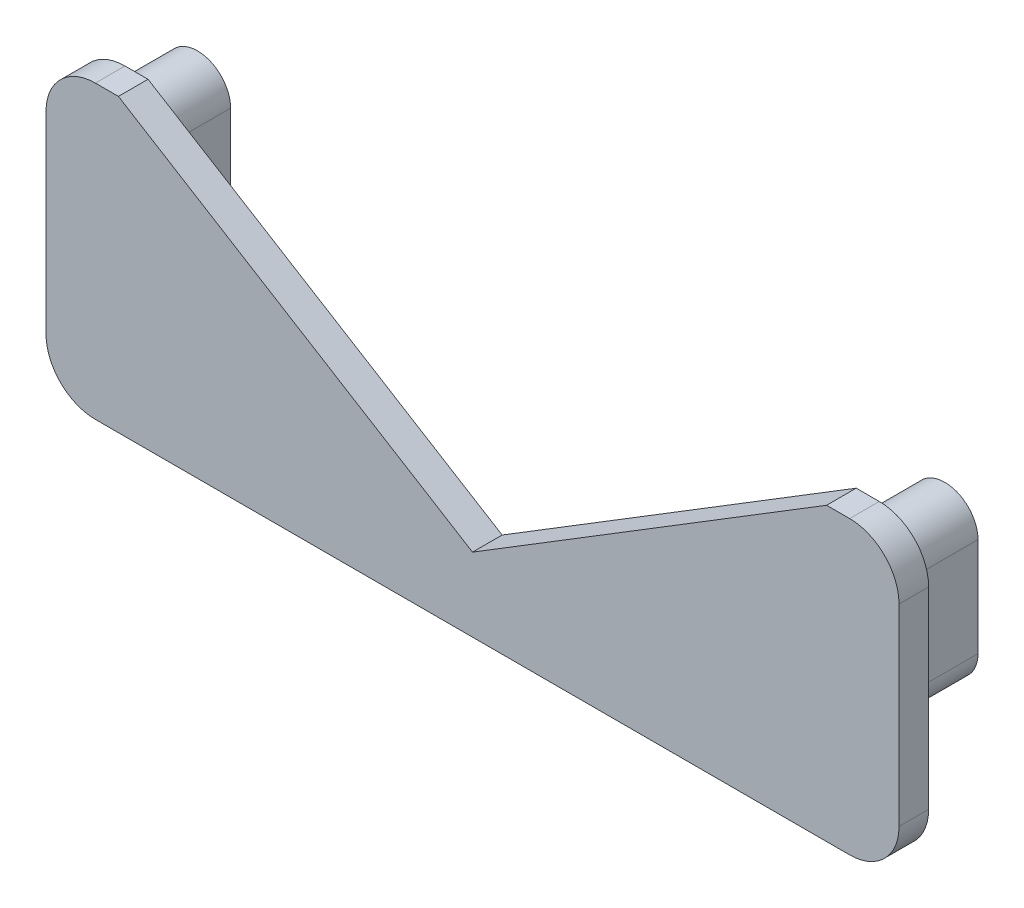
ISO-10303-21;
HEADER;
FILE_DESCRIPTION(('STEP AP214'),'2;1');
FILE_NAME('part.step','',(''),(''),'','','');
FILE_SCHEMA(('AUTOMOTIVE_DESIGN { 1 0 10303 214 1 1 1 1 }'));
ENDSEC;
DATA;
#1=APPLICATION_CONTEXT('core data for automotive mechanical design processes');
#2=APPLICATION_PROTOCOL_DEFINITION('international standard','automotive_design',2000,#1);
#3=PRODUCT_CONTEXT('',#1,'mechanical');
#4=PRODUCT('Part','Part','',(#3));
#5=PRODUCT_RELATED_PRODUCT_CATEGORY('part','',(#4));
#6=PRODUCT_DEFINITION_FORMATION('','',#4);
#7=PRODUCT_DEFINITION_CONTEXT('part definition',#1,'design');
#8=PRODUCT_DEFINITION('design','',#6,#7);
#9=PRODUCT_DEFINITION_SHAPE('','',#8);
#10=(LENGTH_UNIT() NAMED_UNIT(*) SI_UNIT(.MILLI.,.METRE.));
#11=(NAMED_UNIT(*) PLANE_ANGLE_UNIT() SI_UNIT($,.RADIAN.));
#12=(NAMED_UNIT(*) SI_UNIT($,.STERADIAN.) SOLID_ANGLE_UNIT());
#13=UNCERTAINTY_MEASURE_WITH_UNIT(LENGTH_MEASURE(1.E-05),#10,'distance_accuracy_value','');
#14=(GEOMETRIC_REPRESENTATION_CONTEXT(3) GLOBAL_UNCERTAINTY_ASSIGNED_CONTEXT((#13)) GLOBAL_UNIT_ASSIGNED_CONTEXT((#10,
#11,#12)) REPRESENTATION_CONTEXT('',''));
#15=CARTESIAN_POINT('',(0.,0.,0.));
#16=DIRECTION('',(0.,0.,1.));
#17=DIRECTION('',(1.,0.,0.));
#18=AXIS2_PLACEMENT_3D('',#15,#16,#17);
#19=CARTESIAN_POINT('',(-38.2,9.75195405052953,3.));
#20=DIRECTION('',(0.,0.,-1.));
#21=DIRECTION('',(-1.,0.,0.));
#22=AXIS2_PLACEMENT_3D('',#19,#20,#21);
#23=CYLINDRICAL_SURFACE('',#22,5.);
#24=CARTESIAN_POINT('',(-38.2,9.75195405052953,0.));
#25=DIRECTION('',(0.,0.,1.));
#26=DIRECTION('',(1.,0.,0.));
#27=AXIS2_PLACEMENT_3D('',#24,#25,#26);
#28=CIRCLE('',#27,5.);
#29=CARTESIAN_POINT('',(-43.2,9.75195405052953,0.));
#30=VERTEX_POINT('',#29);
#31=CARTESIAN_POINT('',(-38.2,14.7519540505295,0.));
#32=VERTEX_POINT('',#31);
#33=EDGE_CURVE('E227',#30,#32,#28,.F.);
#34=ORIENTED_EDGE('',*,*,#33,.F.);
#35=DIRECTION('',(0.,0.,-1.));
#36=VECTOR('',#35,1.);
#37=CARTESIAN_POINT('',(-43.2,9.75195405052953,3.));
#38=LINE('',#37,#36);
#39=CARTESIAN_POINT('',(-43.2,9.75195405052953,3.));
#40=VERTEX_POINT('',#39);
#41=EDGE_CURVE('E11',#40,#30,#38,.T.);
#42=ORIENTED_EDGE('',*,*,#41,.F.);
#43=CARTESIAN_POINT('',(-38.2,9.75195405052953,3.));
#44=DIRECTION('',(0.,0.,1.));
#45=DIRECTION('',(1.,0.,0.));
#46=AXIS2_PLACEMENT_3D('',#43,#44,#45);
#47=CIRCLE('',#46,5.);
#48=CARTESIAN_POINT('',(-38.2,14.7519540505295,3.));
#49=VERTEX_POINT('',#48);
#50=EDGE_CURVE('E233',#40,#49,#47,.F.);
#51=ORIENTED_EDGE('',*,*,#50,.T.);
#52=DIRECTION('',(0.,0.,-1.));
#53=VECTOR('',#52,1.);
#54=CARTESIAN_POINT('',(-38.2,14.7519540505295,3.));
#55=LINE('',#54,#53);
#56=EDGE_CURVE('E289',#49,#32,#55,.T.);
#57=ORIENTED_EDGE('',*,*,#56,.T.);
#58=EDGE_LOOP('',(#34,#42,#51,#57));
#59=FACE_BOUND('',#58,.T.);
#60=ADVANCED_FACE('F33',(#59),#23,.T.);
#61=CARTESIAN_POINT('',(-43.2,0.,3.));
#62=DIRECTION('',(-1.,0.,0.));
#63=DIRECTION('',(0.,0.,1.));
#64=AXIS2_PLACEMENT_3D('',#61,#62,#63);
#65=PLANE('',#64);
#66=DIRECTION('',(0.,1.,0.));
#67=VECTOR('',#66,1.);
#68=CARTESIAN_POINT('',(-43.2,0.,0.));
#69=LINE('',#68,#67);
#70=CARTESIAN_POINT('',(-43.2,-9.75195405052953,0.));
#71=VERTEX_POINT('',#70);
#72=EDGE_CURVE('E264',#71,#30,#69,.T.);
#73=ORIENTED_EDGE('',*,*,#72,.F.);
#74=DIRECTION('',(0.,0.,-1.));
#75=VECTOR('',#74,1.);
#76=CARTESIAN_POINT('',(-43.2,-9.75195405052953,3.));
#77=LINE('',#76,#75);
#78=CARTESIAN_POINT('',(-43.2,-9.75195405052953,3.));
#79=VERTEX_POINT('',#78);
#80=EDGE_CURVE('E40',#79,#71,#77,.T.);
#81=ORIENTED_EDGE('',*,*,#80,.F.);
#82=DIRECTION('',(0.,1.,0.));
#83=VECTOR('',#82,1.);
#84=CARTESIAN_POINT('',(-43.2,0.,3.));
#85=LINE('',#84,#83);
#86=EDGE_CURVE('E236',#79,#40,#85,.T.);
#87=ORIENTED_EDGE('',*,*,#86,.T.);
#88=ORIENTED_EDGE('',*,*,#41,.T.);
#89=EDGE_LOOP('',(#73,#81,#87,#88));
#90=FACE_BOUND('',#89,.T.);
#91=ADVANCED_FACE('F315',(#90),#65,.T.);
#92=CARTESIAN_POINT('',(-38.2,-9.75195405052953,3.));
#93=DIRECTION('',(0.,0.,-1.));
#94=DIRECTION('',(-1.,0.,0.));
#95=AXIS2_PLACEMENT_3D('',#92,#93,#94);
#96=CYLINDRICAL_SURFACE('',#95,5.);
#97=CARTESIAN_POINT('',(-38.2,-9.75195405052953,0.));
#98=DIRECTION('',(0.,0.,1.));
#99=DIRECTION('',(1.,0.,0.));
#100=AXIS2_PLACEMENT_3D('',#97,#98,#99);
#101=CIRCLE('',#100,5.);
#102=CARTESIAN_POINT('',(-38.2,-14.7519540505295,0.));
#103=VERTEX_POINT('',#102);
#104=EDGE_CURVE('E267',#103,#71,#101,.F.);
#105=ORIENTED_EDGE('',*,*,#104,.F.);
#106=DIRECTION('',(0.,0.,-1.));
#107=VECTOR('',#106,1.);
#108=CARTESIAN_POINT('',(-38.2,-14.7519540505295,3.));
#109=LINE('',#108,#107);
#110=CARTESIAN_POINT('',(-38.2,-14.7519540505295,3.));
#111=VERTEX_POINT('',#110);
#112=EDGE_CURVE('E307',#111,#103,#109,.T.);
#113=ORIENTED_EDGE('',*,*,#112,.F.);
#114=CARTESIAN_POINT('',(-38.2,-9.75195405052953,3.));
#115=DIRECTION('',(0.,0.,1.));
#116=DIRECTION('',(1.,0.,0.));
#117=AXIS2_PLACEMENT_3D('',#114,#115,#116);
#118=CIRCLE('',#117,5.);
#119=EDGE_CURVE('E240',#111,#79,#118,.F.);
#120=ORIENTED_EDGE('',*,*,#119,.T.);
#121=ORIENTED_EDGE('',*,*,#80,.T.);
#122=EDGE_LOOP('',(#105,#113,#120,#121));
#123=FACE_BOUND('',#122,.T.);
#124=ADVANCED_FACE('F311',(#123),#96,.T.);
#125=CARTESIAN_POINT('',(0.,-14.7519540505295,3.));
#126=DIRECTION('',(0.,1.,0.));
#127=DIRECTION('',(0.,0.,1.));
#128=AXIS2_PLACEMENT_3D('',#125,#126,#127);
#129=PLANE('',#128);
#130=DIRECTION('',(1.,0.,0.));
#131=VECTOR('',#130,1.);
#132=CARTESIAN_POINT('',(0.,-14.7519540505295,0.));
#133=LINE('',#132,#131);
#134=CARTESIAN_POINT('',(38.2,-14.7519540505295,0.));
#135=VERTEX_POINT('',#134);
#136=EDGE_CURVE('E270',#103,#135,#133,.T.);
#137=ORIENTED_EDGE('',*,*,#136,.T.);
#138=DIRECTION('',(0.,0.,-1.));
#139=VECTOR('',#138,1.);
#140=CARTESIAN_POINT('',(38.2,-14.7519540505295,3.));
#141=LINE('',#140,#139);
#142=CARTESIAN_POINT('',(38.2,-14.7519540505295,3.));
#143=VERTEX_POINT('',#142);
#144=EDGE_CURVE('E304',#143,#135,#141,.T.);
#145=ORIENTED_EDGE('',*,*,#144,.F.);
#146=DIRECTION('',(1.,0.,0.));
#147=VECTOR('',#146,1.);
#148=CARTESIAN_POINT('',(0.,-14.7519540505295,3.));
#149=LINE('',#148,#147);
#150=EDGE_CURVE('E243',#111,#143,#149,.T.);
#151=ORIENTED_EDGE('',*,*,#150,.F.);
#152=ORIENTED_EDGE('',*,*,#112,.T.);
#153=EDGE_LOOP('',(#137,#145,#151,#152));
#154=FACE_BOUND('',#153,.T.);
#155=ADVANCED_FACE('F324',(#154),#129,.F.);
#156=CARTESIAN_POINT('',(38.2,-9.75195405052953,3.));
#157=DIRECTION('',(0.,0.,-1.));
#158=DIRECTION('',(-1.,0.,0.));
#159=AXIS2_PLACEMENT_3D('',#156,#157,#158);
#160=CYLINDRICAL_SURFACE('',#159,5.);
#161=CARTESIAN_POINT('',(38.2,-9.75195405052953,0.));
#162=DIRECTION('',(0.,0.,1.));
#163=DIRECTION('',(1.,0.,0.));
#164=AXIS2_PLACEMENT_3D('',#161,#162,#163);
#165=CIRCLE('',#164,5.);
#166=CARTESIAN_POINT('',(43.2,-9.75195405052953,0.));
#167=VERTEX_POINT('',#166);
#168=EDGE_CURVE('E272',#135,#167,#165,.T.);
#169=ORIENTED_EDGE('',*,*,#168,.T.);
#170=DIRECTION('',(0.,0.,-1.));
#171=VECTOR('',#170,1.);
#172=CARTESIAN_POINT('',(43.2,-9.75195405052953,3.));
#173=LINE('',#172,#171);
#174=CARTESIAN_POINT('',(43.2,-9.75195405052953,3.));
#175=VERTEX_POINT('',#174);
#176=EDGE_CURVE('E301',#175,#167,#173,.T.);
#177=ORIENTED_EDGE('',*,*,#176,.F.);
#178=CARTESIAN_POINT('',(38.2,-9.75195405052953,3.));
#179=DIRECTION('',(0.,0.,1.));
#180=DIRECTION('',(1.,0.,0.));
#181=AXIS2_PLACEMENT_3D('',#178,#179,#180);
#182=CIRCLE('',#181,5.);
#183=EDGE_CURVE('E245',#143,#175,#182,.T.);
#184=ORIENTED_EDGE('',*,*,#183,.F.);
#185=ORIENTED_EDGE('',*,*,#144,.T.);
#186=EDGE_LOOP('',(#169,#177,#184,#185));
#187=FACE_BOUND('',#186,.T.);
#188=ADVANCED_FACE('F328',(#187),#160,.T.);
#189=CARTESIAN_POINT('',(43.2,0.,3.));
#190=DIRECTION('',(-1.,0.,0.));
#191=DIRECTION('',(0.,0.,1.));
#192=AXIS2_PLACEMENT_3D('',#189,#190,#191);
#193=PLANE('',#192);
#194=DIRECTION('',(0.,1.,0.));
#195=VECTOR('',#194,1.);
#196=CARTESIAN_POINT('',(43.2,0.,0.));
#197=LINE('',#196,#195);
#198=CARTESIAN_POINT('',(43.2,9.75195405052953,0.));
#199=VERTEX_POINT('',#198);
#200=EDGE_CURVE('E274',#167,#199,#197,.T.);
#201=ORIENTED_EDGE('',*,*,#200,.T.);
#202=DIRECTION('',(0.,0.,-1.));
#203=VECTOR('',#202,1.);
#204=CARTESIAN_POINT('',(43.2,9.75195405052953,3.));
#205=LINE('',#204,#203);
#206=CARTESIAN_POINT('',(43.2,9.75195405052953,3.));
#207=VERTEX_POINT('',#206);
#208=EDGE_CURVE('E299',#207,#199,#205,.T.);
#209=ORIENTED_EDGE('',*,*,#208,.F.);
#210=DIRECTION('',(0.,1.,0.));
#211=VECTOR('',#210,1.);
#212=CARTESIAN_POINT('',(43.2,0.,3.));
#213=LINE('',#212,#211);
#214=EDGE_CURVE('E247',#175,#207,#213,.T.);
#215=ORIENTED_EDGE('',*,*,#214,.F.);
#216=ORIENTED_EDGE('',*,*,#176,.T.);
#217=EDGE_LOOP('',(#201,#209,#215,#216));
#218=FACE_BOUND('',#217,.T.);
#219=ADVANCED_FACE('F359',(#218),#193,.F.);
#220=CARTESIAN_POINT('',(38.2,9.75195405052953,3.));
#221=DIRECTION('',(0.,0.,-1.));
#222=DIRECTION('',(-1.,0.,0.));
#223=AXIS2_PLACEMENT_3D('',#220,#221,#222);
#224=CYLINDRICAL_SURFACE('',#223,5.);
#225=CARTESIAN_POINT('',(38.2,9.75195405052953,0.));
#226=DIRECTION('',(0.,0.,1.));
#227=DIRECTION('',(1.,0.,0.));
#228=AXIS2_PLACEMENT_3D('',#225,#226,#227);
#229=CIRCLE('',#228,5.);
#230=CARTESIAN_POINT('',(38.2,14.7519540505295,0.));
#231=VERTEX_POINT('',#230);
#232=EDGE_CURVE('E277',#231,#199,#229,.F.);
#233=ORIENTED_EDGE('',*,*,#232,.F.);
#234=DIRECTION('',(0.,0.,-1.));
#235=VECTOR('',#234,1.);
#236=CARTESIAN_POINT('',(38.2,14.7519540505295,3.));
#237=LINE('',#236,#235);
#238=CARTESIAN_POINT('',(38.2,14.7519540505295,3.));
#239=VERTEX_POINT('',#238);
#240=EDGE_CURVE('E297',#239,#231,#237,.T.);
#241=ORIENTED_EDGE('',*,*,#240,.F.);
#242=CARTESIAN_POINT('',(38.2,9.75195405052953,3.));
#243=DIRECTION('',(0.,0.,1.));
#244=DIRECTION('',(1.,0.,0.));
#245=AXIS2_PLACEMENT_3D('',#242,#243,#244);
#246=CIRCLE('',#245,5.);
#247=EDGE_CURVE('E249',#239,#207,#246,.F.);
#248=ORIENTED_EDGE('',*,*,#247,.T.);
#249=ORIENTED_EDGE('',*,*,#208,.T.);
#250=EDGE_LOOP('',(#233,#241,#248,#249));
#251=FACE_BOUND('',#250,.T.);
#252=ADVANCED_FACE('F357',(#251),#224,.T.);
#253=CARTESIAN_POINT('',(0.,14.7519540505295,3.));
#254=DIRECTION('',(0.,1.,0.));
#255=DIRECTION('',(0.,0.,1.));
#256=AXIS2_PLACEMENT_3D('',#253,#254,#255);
#257=PLANE('',#256);
#258=DIRECTION('',(1.,0.,0.));
#259=VECTOR('',#258,1.);
#260=CARTESIAN_POINT('',(0.,14.7519540505295,0.));
#261=LINE('',#260,#259);
#262=CARTESIAN_POINT('',(35.8659694029692,14.7519540505295,0.));
#263=VERTEX_POINT('',#262);
#264=EDGE_CURVE('E280',#263,#231,#261,.T.);
#265=ORIENTED_EDGE('',*,*,#264,.F.);
#266=DIRECTION('',(0.,0.,-1.));
#267=VECTOR('',#266,1.);
#268=CARTESIAN_POINT('',(35.8659694029692,14.7519540505295,3.));
#269=LINE('',#268,#267);
#270=CARTESIAN_POINT('',(35.8659694029692,14.7519540505295,3.));
#271=VERTEX_POINT('',#270);
#272=EDGE_CURVE('E295',#271,#263,#269,.T.);
#273=ORIENTED_EDGE('',*,*,#272,.F.);
#274=DIRECTION('',(1.,0.,0.));
#275=VECTOR('',#274,1.);
#276=CARTESIAN_POINT('',(0.,14.7519540505295,3.));
#277=LINE('',#276,#275);
#278=EDGE_CURVE('E252',#271,#239,#277,.T.);
#279=ORIENTED_EDGE('',*,*,#278,.T.);
#280=ORIENTED_EDGE('',*,*,#240,.T.);
#281=EDGE_LOOP('',(#265,#273,#279,#280));
#282=FACE_BOUND('',#281,.T.);
#283=ADVANCED_FACE('F354',(#282),#257,.T.);
#284=CARTESIAN_POINT('',(3.25282861578107,-5.29248754943,3.));
#285=DIRECTION('',(-0.52362017763505,0.851951823504967,0.));
#286=DIRECTION('',(-0.851951823504967,-0.52362017763505,0.));
#287=AXIS2_PLACEMENT_3D('',#284,#285,#286);
#288=PLANE('',#287);
#289=DIRECTION('',(0.851951823504967,0.52362017763505,0.));
#290=VECTOR('',#289,1.);
#291=CARTESIAN_POINT('',(3.25282861578107,-5.29248754943,0.));
#292=LINE('',#291,#290);
#293=CARTESIAN_POINT('',(0.,-7.29171643845852,0.));
#294=VERTEX_POINT('',#293);
#295=EDGE_CURVE('E283',#294,#263,#292,.T.);
#296=ORIENTED_EDGE('',*,*,#295,.F.);
#297=DIRECTION('',(0.,0.,-1.));
#298=VECTOR('',#297,1.);
#299=CARTESIAN_POINT('',(0.,-7.29171643845852,3.));
#300=LINE('',#299,#298);
#301=CARTESIAN_POINT('',(0.,-7.29171643845852,3.));
#302=VERTEX_POINT('',#301);
#303=EDGE_CURVE('E293',#302,#294,#300,.T.);
#304=ORIENTED_EDGE('',*,*,#303,.F.);
#305=DIRECTION('',(0.851951823504967,0.52362017763505,0.));
#306=VECTOR('',#305,1.);
#307=CARTESIAN_POINT('',(3.25282861578107,-5.29248754943,3.));
#308=LINE('',#307,#306);
#309=EDGE_CURVE('E255',#302,#271,#308,.T.);
#310=ORIENTED_EDGE('',*,*,#309,.T.);
#311=ORIENTED_EDGE('',*,*,#272,.T.);
#312=EDGE_LOOP('',(#296,#304,#310,#311));
#313=FACE_BOUND('',#312,.T.);
#314=ADVANCED_FACE('F350',(#313),#288,.T.);
#315=CARTESIAN_POINT('',(-3.25282861578107,-5.29248754943,3.));
#316=DIRECTION('',(0.52362017763505,0.851951823504967,0.));
#317=DIRECTION('',(-0.851951823504967,0.52362017763505,0.));
#318=AXIS2_PLACEMENT_3D('',#315,#316,#317);
#319=PLANE('',#318);
#320=DIRECTION('',(0.851951823504967,-0.52362017763505,0.));
#321=VECTOR('',#320,1.);
#322=CARTESIAN_POINT('',(-3.25282861578107,-5.29248754943,0.));
#323=LINE('',#322,#321);
#324=CARTESIAN_POINT('',(-35.8659694029692,14.7519540505295,0.));
#325=VERTEX_POINT('',#324);
#326=EDGE_CURVE('E286',#325,#294,#323,.T.);
#327=ORIENTED_EDGE('',*,*,#326,.F.);
#328=DIRECTION('',(0.,0.,-1.));
#329=VECTOR('',#328,1.);
#330=CARTESIAN_POINT('',(-35.8659694029692,14.7519540505295,3.));
#331=LINE('',#330,#329);
#332=CARTESIAN_POINT('',(-35.8659694029692,14.7519540505295,3.));
#333=VERTEX_POINT('',#332);
#334=EDGE_CURVE('E291',#333,#325,#331,.T.);
#335=ORIENTED_EDGE('',*,*,#334,.F.);
#336=DIRECTION('',(0.851951823504967,-0.52362017763505,0.));
#337=VECTOR('',#336,1.);
#338=CARTESIAN_POINT('',(-3.25282861578107,-5.29248754943,3.));
#339=LINE('',#338,#337);
#340=EDGE_CURVE('E259',#333,#302,#339,.T.);
#341=ORIENTED_EDGE('',*,*,#340,.T.);
#342=ORIENTED_EDGE('',*,*,#303,.T.);
#343=EDGE_LOOP('',(#327,#335,#341,#342));
#344=FACE_BOUND('',#343,.T.);
#345=ADVANCED_FACE('F346',(#344),#319,.T.);
#346=EDGE_CURVE('E237',#32,#325,#261,.T.);
#347=ORIENTED_EDGE('',*,*,#346,.F.);
#348=ORIENTED_EDGE('',*,*,#56,.F.);
#349=EDGE_CURVE('E256',#49,#333,#277,.T.);
#350=ORIENTED_EDGE('',*,*,#349,.T.);
#351=ORIENTED_EDGE('',*,*,#334,.T.);
#352=EDGE_LOOP('',(#347,#348,#350,#351));
#353=FACE_BOUND('',#352,.T.);
#354=ADVANCED_FACE('F343',(#353),#257,.T.);
#355=CARTESIAN_POINT('',(0.,0.,3.));
#356=DIRECTION('',(0.,0.,1.));
#357=DIRECTION('',(1.,0.,0.));
#358=AXIS2_PLACEMENT_3D('',#355,#356,#357);
#359=PLANE('',#358);
#360=ORIENTED_EDGE('',*,*,#50,.F.);
#361=ORIENTED_EDGE('',*,*,#86,.F.);
#362=ORIENTED_EDGE('',*,*,#119,.F.);
#363=ORIENTED_EDGE('',*,*,#150,.T.);
#364=ORIENTED_EDGE('',*,*,#183,.T.);
#365=ORIENTED_EDGE('',*,*,#214,.T.);
#366=ORIENTED_EDGE('',*,*,#247,.F.);
#367=ORIENTED_EDGE('',*,*,#278,.F.);
#368=ORIENTED_EDGE('',*,*,#309,.F.);
#369=ORIENTED_EDGE('',*,*,#340,.F.);
#370=ORIENTED_EDGE('',*,*,#349,.F.);
#371=EDGE_LOOP('',(#360,#361,#362,#363,#364,#365,#366,#367,#368,#369,#370));
#372=FACE_BOUND('',#371,.T.);
#373=ADVANCED_FACE('F333',(#372),#359,.T.);
#374=CARTESIAN_POINT('',(0.,0.,0.));
#375=DIRECTION('',(0.,0.,1.));
#376=DIRECTION('',(1.,0.,0.));
#377=AXIS2_PLACEMENT_3D('',#374,#375,#376);
#378=PLANE('',#377);
#379=CARTESIAN_POINT('',(-37.85,9.40195405052953,0.));
#380=DIRECTION('',(0.,0.,1.));
#381=DIRECTION('',(1.,0.,0.));
#382=AXIS2_PLACEMENT_3D('',#379,#380,#381);
#383=CIRCLE('',#382,3.34999999999998);
#384=CARTESIAN_POINT('',(-34.5,9.40195405052953,0.));
#385=VERTEX_POINT('',#384);
#386=CARTESIAN_POINT('',(-41.2,9.40195405052953,0.));
#387=VERTEX_POINT('',#386);
#388=EDGE_CURVE('E188',#385,#387,#383,.T.);
#389=ORIENTED_EDGE('',*,*,#388,.T.);
#390=DIRECTION('',(0.,-1.,0.));
#391=VECTOR('',#390,1.);
#392=CARTESIAN_POINT('',(-41.2,0.,0.));
#393=LINE('',#392,#391);
#394=CARTESIAN_POINT('',(-41.2,-0.598045949470472,0.));
#395=VERTEX_POINT('',#394);
#396=EDGE_CURVE('E195',#387,#395,#393,.T.);
#397=ORIENTED_EDGE('',*,*,#396,.T.);
#398=CARTESIAN_POINT('',(-37.85,-0.598045949470472,0.));
#399=DIRECTION('',(0.,0.,1.));
#400=DIRECTION('',(1.,0.,0.));
#401=AXIS2_PLACEMENT_3D('',#398,#399,#400);
#402=CIRCLE('',#401,3.34999999999999);
#403=CARTESIAN_POINT('',(-34.5,-0.598045949470472,0.));
#404=VERTEX_POINT('',#403);
#405=EDGE_CURVE('E169',#395,#404,#402,.T.);
#406=ORIENTED_EDGE('',*,*,#405,.T.);
#407=DIRECTION('',(0.,-1.,0.));
#408=VECTOR('',#407,1.);
#409=CARTESIAN_POINT('',(-34.5,0.,0.));
#410=LINE('',#409,#408);
#411=EDGE_CURVE('E47',#385,#404,#410,.T.);
#412=ORIENTED_EDGE('',*,*,#411,.F.);
#413=EDGE_LOOP('',(#389,#397,#406,#412));
#414=FACE_BOUND('',#413,.T.);
#415=CARTESIAN_POINT('',(37.85,9.40195405052953,0.));
#416=DIRECTION('',(0.,0.,1.));
#417=DIRECTION('',(1.,0.,0.));
#418=AXIS2_PLACEMENT_3D('',#415,#416,#417);
#419=CIRCLE('',#418,3.35);
#420=CARTESIAN_POINT('',(41.2,9.40195405052953,0.));
#421=VERTEX_POINT('',#420);
#422=CARTESIAN_POINT('',(34.5,9.40195405052953,0.));
#423=VERTEX_POINT('',#422);
#424=EDGE_CURVE('E208',#421,#423,#419,.T.);
#425=ORIENTED_EDGE('',*,*,#424,.T.);
#426=DIRECTION('',(0.,-1.,0.));
#427=VECTOR('',#426,1.);
#428=CARTESIAN_POINT('',(34.5,0.,0.));
#429=LINE('',#428,#427);
#430=CARTESIAN_POINT('',(34.5,-0.598045949470472,0.));
#431=VERTEX_POINT('',#430);
#432=EDGE_CURVE('E200',#423,#431,#429,.T.);
#433=ORIENTED_EDGE('',*,*,#432,.T.);
#434=CARTESIAN_POINT('',(37.85,-0.598045949470472,0.));
#435=DIRECTION('',(0.,0.,1.));
#436=DIRECTION('',(1.,0.,0.));
#437=AXIS2_PLACEMENT_3D('',#434,#435,#436);
#438=CIRCLE('',#437,3.35);
#439=CARTESIAN_POINT('',(41.2,-0.598045949470472,0.));
#440=VERTEX_POINT('',#439);
#441=EDGE_CURVE('E219',#431,#440,#438,.T.);
#442=ORIENTED_EDGE('',*,*,#441,.T.);
#443=DIRECTION('',(0.,-1.,0.));
#444=VECTOR('',#443,1.);
#445=CARTESIAN_POINT('',(41.2,0.,0.));
#446=LINE('',#445,#444);
#447=EDGE_CURVE('E55',#421,#440,#446,.T.);
#448=ORIENTED_EDGE('',*,*,#447,.F.);
#449=EDGE_LOOP('',(#425,#433,#442,#448));
#450=FACE_BOUND('',#449,.T.);
#451=ORIENTED_EDGE('',*,*,#33,.T.);
#452=ORIENTED_EDGE('',*,*,#346,.T.);
#453=ORIENTED_EDGE('',*,*,#326,.T.);
#454=ORIENTED_EDGE('',*,*,#295,.T.);
#455=ORIENTED_EDGE('',*,*,#264,.T.);
#456=ORIENTED_EDGE('',*,*,#232,.T.);
#457=ORIENTED_EDGE('',*,*,#200,.F.);
#458=ORIENTED_EDGE('',*,*,#168,.F.);
#459=ORIENTED_EDGE('',*,*,#136,.F.);
#460=ORIENTED_EDGE('',*,*,#104,.T.);
#461=ORIENTED_EDGE('',*,*,#72,.T.);
#462=EDGE_LOOP('',(#451,#452,#453,#454,#455,#456,#457,#458,#459,#460,#461));
#463=FACE_BOUND('',#462,.T.);
#464=ADVANCED_FACE('F319',(#414,#450,#463),#378,.F.);
#465=CARTESIAN_POINT('',(34.5,0.,-7.));
#466=DIRECTION('',(-1.,0.,0.));
#467=DIRECTION('',(0.,0.,1.));
#468=AXIS2_PLACEMENT_3D('',#465,#466,#467);
#469=PLANE('',#468);
#470=ORIENTED_EDGE('',*,*,#432,.F.);
#471=DIRECTION('',(0.,0.,1.));
#472=VECTOR('',#471,1.);
#473=CARTESIAN_POINT('',(34.5,9.40195405052953,-7.));
#474=LINE('',#473,#472);
#475=CARTESIAN_POINT('',(34.5,9.40195405052953,-7.));
#476=VERTEX_POINT('',#475);
#477=EDGE_CURVE('E225',#476,#423,#474,.T.);
#478=ORIENTED_EDGE('',*,*,#477,.F.);
#479=DIRECTION('',(0.,-1.,0.));
#480=VECTOR('',#479,1.);
#481=CARTESIAN_POINT('',(34.5,0.,-7.));
#482=LINE('',#481,#480);
#483=CARTESIAN_POINT('',(34.5,-0.598045949470472,-7.));
#484=VERTEX_POINT('',#483);
#485=EDGE_CURVE('E204',#476,#484,#482,.T.);
#486=ORIENTED_EDGE('',*,*,#485,.T.);
#487=DIRECTION('',(0.,0.,1.));
#488=VECTOR('',#487,1.);
#489=CARTESIAN_POINT('',(34.5,-0.598045949470472,-7.));
#490=LINE('',#489,#488);
#491=EDGE_CURVE('E216',#484,#431,#490,.T.);
#492=ORIENTED_EDGE('',*,*,#491,.T.);
#493=EDGE_LOOP('',(#470,#478,#486,#492));
#494=FACE_BOUND('',#493,.T.);
#495=ADVANCED_FACE('F444',(#494),#469,.T.);
#496=CARTESIAN_POINT('',(37.85,9.40195405052953,-7.));
#497=DIRECTION('',(0.,0.,1.));
#498=DIRECTION('',(1.,0.,0.));
#499=AXIS2_PLACEMENT_3D('',#496,#497,#498);
#500=CYLINDRICAL_SURFACE('',#499,3.35);
#501=ORIENTED_EDGE('',*,*,#424,.F.);
#502=DIRECTION('',(0.,0.,1.));
#503=VECTOR('',#502,1.);
#504=CARTESIAN_POINT('',(41.2,9.40195405052953,-7.));
#505=LINE('',#504,#503);
#506=CARTESIAN_POINT('',(41.2,9.40195405052953,-7.));
#507=VERTEX_POINT('',#506);
#508=EDGE_CURVE('E228',#507,#421,#505,.T.);
#509=ORIENTED_EDGE('',*,*,#508,.F.);
#510=CARTESIAN_POINT('',(37.85,9.40195405052953,-7.));
#511=DIRECTION('',(0.,0.,1.));
#512=DIRECTION('',(1.,0.,0.));
#513=AXIS2_PLACEMENT_3D('',#510,#511,#512);
#514=CIRCLE('',#513,3.35);
#515=EDGE_CURVE('E213',#507,#476,#514,.T.);
#516=ORIENTED_EDGE('',*,*,#515,.T.);
#517=ORIENTED_EDGE('',*,*,#477,.T.);
#518=EDGE_LOOP('',(#501,#509,#516,#517));
#519=FACE_BOUND('',#518,.T.);
#520=ADVANCED_FACE('F454',(#519),#500,.T.);
#521=CARTESIAN_POINT('',(41.2,0.,-7.));
#522=DIRECTION('',(-1.,0.,0.));
#523=DIRECTION('',(0.,0.,1.));
#524=AXIS2_PLACEMENT_3D('',#521,#522,#523);
#525=PLANE('',#524);
#526=ORIENTED_EDGE('',*,*,#447,.T.);
#527=DIRECTION('',(0.,0.,1.));
#528=VECTOR('',#527,1.);
#529=CARTESIAN_POINT('',(41.2,-0.598045949470472,-7.));
#530=LINE('',#529,#528);
#531=CARTESIAN_POINT('',(41.2,-0.598045949470472,-7.));
#532=VERTEX_POINT('',#531);
#533=EDGE_CURVE('E230',#532,#440,#530,.T.);
#534=ORIENTED_EDGE('',*,*,#533,.F.);
#535=DIRECTION('',(0.,-1.,0.));
#536=VECTOR('',#535,1.);
#537=CARTESIAN_POINT('',(41.2,0.,-7.));
#538=LINE('',#537,#536);
#539=EDGE_CURVE('E211',#507,#532,#538,.T.);
#540=ORIENTED_EDGE('',*,*,#539,.F.);
#541=ORIENTED_EDGE('',*,*,#508,.T.);
#542=EDGE_LOOP('',(#526,#534,#540,#541));
#543=FACE_BOUND('',#542,.T.);
#544=ADVANCED_FACE('F464',(#543),#525,.F.);
#545=CARTESIAN_POINT('',(37.85,-0.598045949470472,-7.));
#546=DIRECTION('',(0.,0.,1.));
#547=DIRECTION('',(1.,0.,0.));
#548=AXIS2_PLACEMENT_3D('',#545,#546,#547);
#549=CYLINDRICAL_SURFACE('',#548,3.35);
#550=ORIENTED_EDGE('',*,*,#441,.F.);
#551=ORIENTED_EDGE('',*,*,#491,.F.);
#552=CARTESIAN_POINT('',(37.85,-0.598045949470472,-7.));
#553=DIRECTION('',(0.,0.,1.));
#554=DIRECTION('',(1.,0.,0.));
#555=AXIS2_PLACEMENT_3D('',#552,#553,#554);
#556=CIRCLE('',#555,3.35);
#557=EDGE_CURVE('E207',#484,#532,#556,.T.);
#558=ORIENTED_EDGE('',*,*,#557,.T.);
#559=ORIENTED_EDGE('',*,*,#533,.T.);
#560=EDGE_LOOP('',(#550,#551,#558,#559));
#561=FACE_BOUND('',#560,.T.);
#562=ADVANCED_FACE('F474',(#561),#549,.T.);
#563=CARTESIAN_POINT('',(0.,0.,-7.));
#564=DIRECTION('',(0.,0.,1.));
#565=DIRECTION('',(1.,0.,0.));
#566=AXIS2_PLACEMENT_3D('',#563,#564,#565);
#567=PLANE('',#566);
#568=ORIENTED_EDGE('',*,*,#485,.F.);
#569=ORIENTED_EDGE('',*,*,#515,.F.);
#570=ORIENTED_EDGE('',*,*,#539,.T.);
#571=ORIENTED_EDGE('',*,*,#557,.F.);
#572=EDGE_LOOP('',(#568,#569,#570,#571));
#573=FACE_BOUND('',#572,.T.);
#574=ADVANCED_FACE('F483',(#573),#567,.F.);
#575=CARTESIAN_POINT('',(-41.2,0.,-7.));
#576=DIRECTION('',(-1.,0.,0.));
#577=DIRECTION('',(0.,-1.,0.));
#578=AXIS2_PLACEMENT_3D('',#575,#576,#577);
#579=PLANE('',#578);
#580=ORIENTED_EDGE('',*,*,#396,.F.);
#581=DIRECTION('',(0.,0.,1.));
#582=VECTOR('',#581,1.);
#583=CARTESIAN_POINT('',(-41.2,9.40195405052953,-7.));
#584=LINE('',#583,#582);
#585=CARTESIAN_POINT('',(-41.2,9.40195405052953,-7.));
#586=VERTEX_POINT('',#585);
#587=EDGE_CURVE('E187',#586,#387,#584,.T.);
#588=ORIENTED_EDGE('',*,*,#587,.F.);
#589=DIRECTION('',(0.,-1.,0.));
#590=VECTOR('',#589,1.);
#591=CARTESIAN_POINT('',(-41.2,0.,-7.));
#592=LINE('',#591,#590);
#593=CARTESIAN_POINT('',(-41.2,-0.598045949470472,-7.));
#594=VERTEX_POINT('',#593);
#595=EDGE_CURVE('E181',#586,#594,#592,.T.);
#596=ORIENTED_EDGE('',*,*,#595,.T.);
#597=DIRECTION('',(0.,0.,1.));
#598=VECTOR('',#597,1.);
#599=CARTESIAN_POINT('',(-41.2,-0.598045949470472,-7.));
#600=LINE('',#599,#598);
#601=EDGE_CURVE('E164',#594,#395,#600,.T.);
#602=ORIENTED_EDGE('',*,*,#601,.T.);
#603=EDGE_LOOP('',(#580,#588,#596,#602));
#604=FACE_BOUND('',#603,.T.);
#605=ADVANCED_FACE('F186',(#604),#579,.T.);
#606=CARTESIAN_POINT('',(-37.85,9.40195405052953,-7.));
#607=DIRECTION('',(0.,0.,1.));
#608=DIRECTION('',(1.,0.,0.));
#609=AXIS2_PLACEMENT_3D('',#606,#607,#608);
#610=CYLINDRICAL_SURFACE('',#609,3.34999999999998);
#611=ORIENTED_EDGE('',*,*,#388,.F.);
#612=DIRECTION('',(0.,0.,1.));
#613=VECTOR('',#612,1.);
#614=CARTESIAN_POINT('',(-34.5,9.40195405052953,-7.));
#615=LINE('',#614,#613);
#616=CARTESIAN_POINT('',(-34.5,9.40195405052953,-7.));
#617=VERTEX_POINT('',#616);
#618=EDGE_CURVE('E201',#617,#385,#615,.T.);
#619=ORIENTED_EDGE('',*,*,#618,.F.);
#620=CARTESIAN_POINT('',(-37.85,9.40195405052953,-7.));
#621=DIRECTION('',(0.,0.,1.));
#622=DIRECTION('',(1.,0.,0.));
#623=AXIS2_PLACEMENT_3D('',#620,#621,#622);
#624=CIRCLE('',#623,3.34999999999998);
#625=EDGE_CURVE('E175',#617,#586,#624,.T.);
#626=ORIENTED_EDGE('',*,*,#625,.T.);
#627=ORIENTED_EDGE('',*,*,#587,.T.);
#628=EDGE_LOOP('',(#611,#619,#626,#627));
#629=FACE_BOUND('',#628,.T.);
#630=ADVANCED_FACE('F502',(#629),#610,.T.);
#631=CARTESIAN_POINT('',(-34.5,0.,-7.));
#632=DIRECTION('',(-1.,0.,0.));
#633=DIRECTION('',(0.,-1.,0.));
#634=AXIS2_PLACEMENT_3D('',#631,#632,#633);
#635=PLANE('',#634);
#636=ORIENTED_EDGE('',*,*,#411,.T.);
#637=DIRECTION('',(0.,0.,1.));
#638=VECTOR('',#637,1.);
#639=CARTESIAN_POINT('',(-34.5,-0.598045949470472,-7.));
#640=LINE('',#639,#638);
#641=CARTESIAN_POINT('',(-34.5,-0.598045949470472,-7.));
#642=VERTEX_POINT('',#641);
#643=EDGE_CURVE('E174',#642,#404,#640,.T.);
#644=ORIENTED_EDGE('',*,*,#643,.F.);
#645=DIRECTION('',(0.,-1.,0.));
#646=VECTOR('',#645,1.);
#647=CARTESIAN_POINT('',(-34.5,0.,-7.));
#648=LINE('',#647,#646);
#649=EDGE_CURVE('E184',#617,#642,#648,.T.);
#650=ORIENTED_EDGE('',*,*,#649,.F.);
#651=ORIENTED_EDGE('',*,*,#618,.T.);
#652=EDGE_LOOP('',(#636,#644,#650,#651));
#653=FACE_BOUND('',#652,.T.);
#654=ADVANCED_FACE('F511',(#653),#635,.F.);
#655=CARTESIAN_POINT('',(-37.85,-0.598045949470472,-7.));
#656=DIRECTION('',(0.,0.,1.));
#657=DIRECTION('',(1.,0.,0.));
#658=AXIS2_PLACEMENT_3D('',#655,#656,#657);
#659=CYLINDRICAL_SURFACE('',#658,3.34999999999999);
#660=ORIENTED_EDGE('',*,*,#405,.F.);
#661=ORIENTED_EDGE('',*,*,#601,.F.);
#662=CARTESIAN_POINT('',(-37.85,-0.598045949470472,-7.));
#663=DIRECTION('',(0.,0.,1.));
#664=DIRECTION('',(1.,0.,0.));
#665=AXIS2_PLACEMENT_3D('',#662,#663,#664);
#666=CIRCLE('',#665,3.34999999999999);
#667=EDGE_CURVE('E167',#594,#642,#666,.T.);
#668=ORIENTED_EDGE('',*,*,#667,.T.);
#669=ORIENTED_EDGE('',*,*,#643,.T.);
#670=EDGE_LOOP('',(#660,#661,#668,#669));
#671=FACE_BOUND('',#670,.T.);
#672=ADVANCED_FACE('F166',(#671),#659,.T.);
#673=CARTESIAN_POINT('',(0.,0.,-7.));
#674=DIRECTION('',(0.,0.,1.));
#675=DIRECTION('',(1.,0.,0.));
#676=AXIS2_PLACEMENT_3D('',#673,#674,#675);
#677=PLANE('',#676);
#678=ORIENTED_EDGE('',*,*,#595,.F.);
#679=ORIENTED_EDGE('',*,*,#625,.F.);
#680=ORIENTED_EDGE('',*,*,#649,.T.);
#681=ORIENTED_EDGE('',*,*,#667,.F.);
#682=EDGE_LOOP('',(#678,#679,#680,#681));
#683=FACE_BOUND('',#682,.T.);
#684=ADVANCED_FACE('F179',(#683),#677,.F.);
#685=CLOSED_SHELL('',(#60,#91,#124,#155,#188,#219,#252,#283,#314,#345,#354,#373,#464,#495,#520,
#544,#562,#574,#605,#630,#654,#672,#684));
#686=MANIFOLD_SOLID_BREP('B2',#685);
#687=ADVANCED_BREP_SHAPE_REPRESENTATION('',(#18,#686),#14);
#688=SHAPE_DEFINITION_REPRESENTATION(#9,#687);
ENDSEC;
END-ISO-10303-21;
